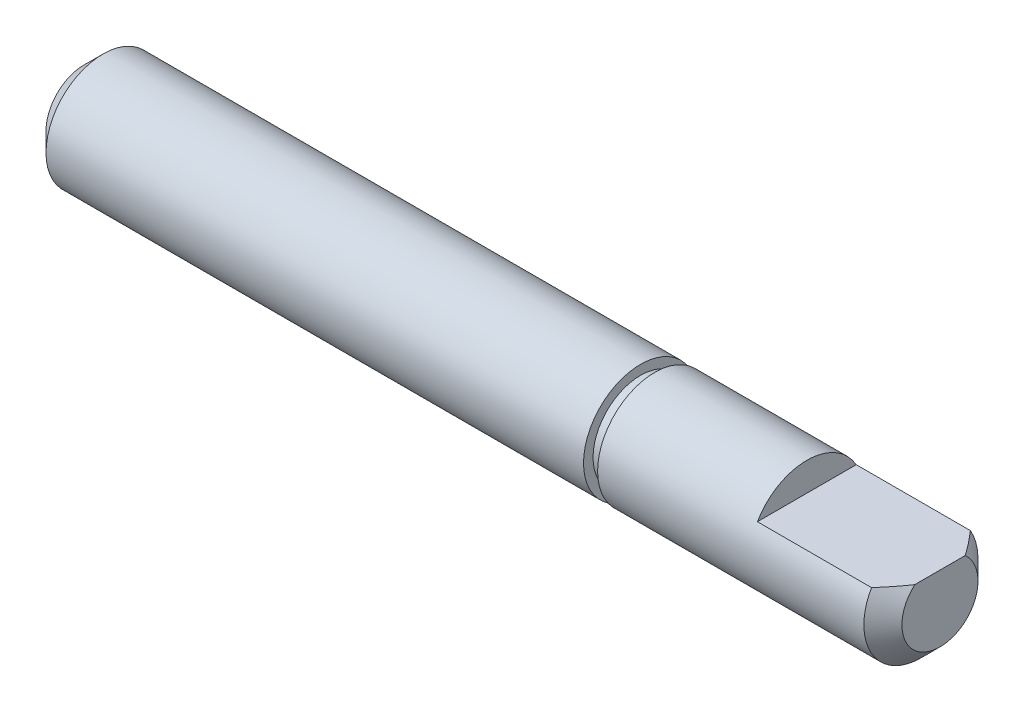
ISO-10303-21;
HEADER;
FILE_DESCRIPTION(('STEP AP214'),'2;1');
FILE_NAME('part.step','',(''),(''),'','','');
FILE_SCHEMA(('AUTOMOTIVE_DESIGN { 1 0 10303 214 1 1 1 1 }'));
ENDSEC;
DATA;
#1=APPLICATION_CONTEXT('core data for automotive mechanical design processes');
#2=APPLICATION_PROTOCOL_DEFINITION('international standard','automotive_design',2000,#1);
#3=PRODUCT_CONTEXT('',#1,'mechanical');
#4=PRODUCT('Part','Part','',(#3));
#5=PRODUCT_RELATED_PRODUCT_CATEGORY('part','',(#4));
#6=PRODUCT_DEFINITION_FORMATION('','',#4);
#7=PRODUCT_DEFINITION_CONTEXT('part definition',#1,'design');
#8=PRODUCT_DEFINITION('design','',#6,#7);
#9=PRODUCT_DEFINITION_SHAPE('','',#8);
#10=(LENGTH_UNIT() NAMED_UNIT(*) SI_UNIT(.MILLI.,.METRE.));
#11=(NAMED_UNIT(*) PLANE_ANGLE_UNIT() SI_UNIT($,.RADIAN.));
#12=(NAMED_UNIT(*) SI_UNIT($,.STERADIAN.) SOLID_ANGLE_UNIT());
#13=UNCERTAINTY_MEASURE_WITH_UNIT(LENGTH_MEASURE(1.E-05),#10,'distance_accuracy_value','');
#14=(GEOMETRIC_REPRESENTATION_CONTEXT(3) GLOBAL_UNCERTAINTY_ASSIGNED_CONTEXT((#13)) GLOBAL_UNIT_ASSIGNED_CONTEXT((#10,
#11,#12)) REPRESENTATION_CONTEXT('',''));
#15=CARTESIAN_POINT('',(0.,0.,0.));
#16=DIRECTION('',(0.,0.,1.));
#17=DIRECTION('',(1.,0.,0.));
#18=AXIS2_PLACEMENT_3D('',#15,#16,#17);
#19=CARTESIAN_POINT('',(0.,0.,0.));
#20=DIRECTION('',(1.,0.,0.));
#21=DIRECTION('',(0.,0.,-1.));
#22=AXIS2_PLACEMENT_3D('',#19,#20,#21);
#23=PLANE('',#22);
#24=CARTESIAN_POINT('',(0.,0.,0.));
#25=DIRECTION('',(-1.,0.,0.));
#26=DIRECTION('',(0.,0.,1.));
#27=AXIS2_PLACEMENT_3D('',#24,#25,#26);
#28=CIRCLE('',#27,2.);
#29=CARTESIAN_POINT('',(0.,0.,2.));
#30=VERTEX_POINT('',#29);
#31=EDGE_CURVE('E65',#30,#30,#28,.T.);
#32=ORIENTED_EDGE('',*,*,#31,.T.);
#33=EDGE_LOOP('',(#32));
#34=FACE_BOUND('',#33,.T.);
#35=ADVANCED_FACE('F31',(#34),#23,.F.);
#36=CARTESIAN_POINT('',(1.,0.,0.));
#37=DIRECTION('',(1.,0.,0.));
#38=DIRECTION('',(0.,0.,-1.));
#39=AXIS2_PLACEMENT_3D('',#36,#37,#38);
#40=CONICAL_SURFACE('',#39,3.,0.785398163397448);
#41=ORIENTED_EDGE('',*,*,#31,.F.);
#42=EDGE_LOOP('',(#41));
#43=FACE_BOUND('',#42,.T.);
#44=CARTESIAN_POINT('',(1.,0.,0.));
#45=DIRECTION('',(-1.,0.,0.));
#46=DIRECTION('',(0.,0.,1.));
#47=AXIS2_PLACEMENT_3D('',#44,#45,#46);
#48=CIRCLE('',#47,3.);
#49=CARTESIAN_POINT('',(1.,0.,3.));
#50=VERTEX_POINT('',#49);
#51=EDGE_CURVE('E93',#50,#50,#48,.T.);
#52=ORIENTED_EDGE('',*,*,#51,.T.);
#53=EDGE_LOOP('',(#52));
#54=FACE_BOUND('',#53,.T.);
#55=ADVANCED_FACE('F100',(#43,#54),#40,.T.);
#56=CARTESIAN_POINT('',(-55.9394280762565,0.,0.));
#57=DIRECTION('',(-1.,0.,0.));
#58=DIRECTION('',(0.,0.,1.));
#59=AXIS2_PLACEMENT_3D('',#56,#57,#58);
#60=CYLINDRICAL_SURFACE('',#59,3.);
#61=ORIENTED_EDGE('',*,*,#51,.F.);
#62=EDGE_LOOP('',(#61));
#63=FACE_BOUND('',#62,.T.);
#64=CARTESIAN_POINT('',(29.26,0.,0.));
#65=DIRECTION('',(-1.,0.,0.));
#66=DIRECTION('',(0.,0.,1.));
#67=AXIS2_PLACEMENT_3D('',#64,#65,#66);
#68=CIRCLE('',#67,3.);
#69=CARTESIAN_POINT('',(29.26,0.,3.));
#70=VERTEX_POINT('',#69);
#71=EDGE_CURVE('E90',#70,#70,#68,.T.);
#72=ORIENTED_EDGE('',*,*,#71,.T.);
#73=EDGE_LOOP('',(#72));
#74=FACE_BOUND('',#73,.T.);
#75=ADVANCED_FACE('F103',(#63,#74),#60,.T.);
#76=CARTESIAN_POINT('',(29.26,3.,0.));
#77=DIRECTION('',(-1.,0.,0.));
#78=DIRECTION('',(0.,0.,1.));
#79=AXIS2_PLACEMENT_3D('',#76,#77,#78);
#80=PLANE('',#79);
#81=ORIENTED_EDGE('',*,*,#71,.F.);
#82=EDGE_LOOP('',(#81));
#83=FACE_BOUND('',#82,.T.);
#84=CARTESIAN_POINT('',(29.26,0.,0.));
#85=DIRECTION('',(-1.,0.,0.));
#86=DIRECTION('',(0.,0.,1.));
#87=AXIS2_PLACEMENT_3D('',#84,#85,#86);
#88=CIRCLE('',#87,2.5);
#89=CARTESIAN_POINT('',(29.26,0.,2.5));
#90=VERTEX_POINT('',#89);
#91=EDGE_CURVE('E87',#90,#90,#88,.T.);
#92=ORIENTED_EDGE('',*,*,#91,.T.);
#93=EDGE_LOOP('',(#92));
#94=FACE_BOUND('',#93,.T.);
#95=ADVANCED_FACE('F108',(#83,#94),#80,.F.);
#96=CARTESIAN_POINT('',(-55.9394280762565,0.,0.));
#97=DIRECTION('',(-1.,0.,0.));
#98=DIRECTION('',(0.,0.,1.));
#99=AXIS2_PLACEMENT_3D('',#96,#97,#98);
#100=CYLINDRICAL_SURFACE('',#99,2.5);
#101=ORIENTED_EDGE('',*,*,#91,.F.);
#102=EDGE_LOOP('',(#101));
#103=FACE_BOUND('',#102,.T.);
#104=CARTESIAN_POINT('',(30.,0.,0.));
#105=DIRECTION('',(-1.,0.,0.));
#106=DIRECTION('',(0.,0.,1.));
#107=AXIS2_PLACEMENT_3D('',#104,#105,#106);
#108=CIRCLE('',#107,2.5);
#109=CARTESIAN_POINT('',(30.,0.,2.5));
#110=VERTEX_POINT('',#109);
#111=EDGE_CURVE('E84',#110,#110,#108,.T.);
#112=ORIENTED_EDGE('',*,*,#111,.T.);
#113=EDGE_LOOP('',(#112));
#114=FACE_BOUND('',#113,.T.);
#115=ADVANCED_FACE('F114',(#103,#114),#100,.T.);
#116=CARTESIAN_POINT('',(30.,2.5,0.));
#117=DIRECTION('',(1.,0.,0.));
#118=DIRECTION('',(0.,0.,-1.));
#119=AXIS2_PLACEMENT_3D('',#116,#117,#118);
#120=PLANE('',#119);
#121=ORIENTED_EDGE('',*,*,#111,.F.);
#122=EDGE_LOOP('',(#121));
#123=FACE_BOUND('',#122,.T.);
#124=CARTESIAN_POINT('',(30.,0.,0.));
#125=DIRECTION('',(-1.,0.,0.));
#126=DIRECTION('',(0.,0.,1.));
#127=AXIS2_PLACEMENT_3D('',#124,#125,#126);
#128=CIRCLE('',#127,3.);
#129=CARTESIAN_POINT('',(30.,0.,3.));
#130=VERTEX_POINT('',#129);
#131=EDGE_CURVE('E77',#130,#130,#128,.T.);
#132=ORIENTED_EDGE('',*,*,#131,.T.);
#133=EDGE_LOOP('',(#132));
#134=FACE_BOUND('',#133,.T.);
#135=ADVANCED_FACE('F120',(#123,#134),#120,.F.);
#136=CARTESIAN_POINT('',(-55.9394280762565,0.,0.));
#137=DIRECTION('',(-1.,0.,0.));
#138=DIRECTION('',(0.,0.,1.));
#139=AXIS2_PLACEMENT_3D('',#136,#137,#138);
#140=CYLINDRICAL_SURFACE('',#139,3.);
#141=CARTESIAN_POINT('',(44.,0.,0.));
#142=DIRECTION('',(-1.,0.,0.));
#143=DIRECTION('',(0.,0.,1.));
#144=AXIS2_PLACEMENT_3D('',#141,#142,#143);
#145=CIRCLE('',#144,3.);
#146=CARTESIAN_POINT('',(43.9999999999999,1.5,-2.59807621135347));
#147=VERTEX_POINT('',#146);
#148=CARTESIAN_POINT('',(44.,1.5,2.59807621135332));
#149=VERTEX_POINT('',#148);
#150=EDGE_CURVE('E71',#147,#149,#145,.T.);
#151=ORIENTED_EDGE('',*,*,#150,.T.);
#152=DIRECTION('',(-1.,0.,0.));
#153=VECTOR('',#152,1.);
#154=CARTESIAN_POINT('',(-55.9394280762565,1.5,2.59807621135332));
#155=LINE('',#154,#153);
#156=CARTESIAN_POINT('',(38.,1.5,2.59807621135332));
#157=VERTEX_POINT('',#156);
#158=EDGE_CURVE('E73',#149,#157,#155,.T.);
#159=ORIENTED_EDGE('',*,*,#158,.T.);
#160=CARTESIAN_POINT('',(38.,0.,0.));
#161=DIRECTION('',(1.,0.,0.));
#162=DIRECTION('',(0.,0.,-1.));
#163=AXIS2_PLACEMENT_3D('',#160,#161,#162);
#164=CIRCLE('',#163,3.);
#165=CARTESIAN_POINT('',(38.,1.5,-2.59807621135332));
#166=VERTEX_POINT('',#165);
#167=EDGE_CURVE('E11',#166,#157,#164,.T.);
#168=ORIENTED_EDGE('',*,*,#167,.F.);
#169=DIRECTION('',(-1.,0.,0.));
#170=VECTOR('',#169,1.);
#171=CARTESIAN_POINT('',(-55.9394280762565,1.5,-2.59807621135332));
#172=LINE('',#171,#170);
#173=EDGE_CURVE('E72',#166,#147,#172,.F.);
#174=ORIENTED_EDGE('',*,*,#173,.T.);
#175=EDGE_LOOP('',(#151,#159,#168,#174));
#176=FACE_BOUND('',#175,.T.);
#177=ORIENTED_EDGE('',*,*,#131,.F.);
#178=EDGE_LOOP('',(#177));
#179=FACE_BOUND('',#178,.T.);
#180=ADVANCED_FACE('F126',(#176,#179),#140,.T.);
#181=CARTESIAN_POINT('',(45.,0.,0.));
#182=DIRECTION('',(-1.,0.,0.));
#183=DIRECTION('',(0.,0.,1.));
#184=AXIS2_PLACEMENT_3D('',#181,#182,#183);
#185=CONICAL_SURFACE('',#184,2.,0.785398163397448);
#186=ORIENTED_EDGE('',*,*,#150,.F.);
#187=CARTESIAN_POINT('',(40.3501424818211,1.5,-6.47847242890489));
#188=CARTESIAN_POINT('',(40.5159520862638,1.5,-6.30826369867918));
#189=CARTESIAN_POINT('',(40.6816034889832,1.5,-6.13790027920319));
#190=CARTESIAN_POINT('',(41.0124752643252,1.5,-5.79674247770871));
#191=CARTESIAN_POINT('',(41.1776956197278,1.5,-5.62594807899323));
#192=CARTESIAN_POINT('',(41.5079039197653,1.5,-5.28348168449548));
#193=CARTESIAN_POINT('',(41.6728907579318,1.5,-5.11180862097958));
#194=CARTESIAN_POINT('',(42.0021080240068,1.5,-4.76774856310163));
#195=CARTESIAN_POINT('',(42.1663384752345,1.5,-4.59536159106456));
#196=CARTESIAN_POINT('',(42.5060291970537,1.5,-4.23666789611256));
#197=CARTESIAN_POINT('',(42.6814095921959,1.5,-4.05028536889546));
#198=CARTESIAN_POINT('',(43.0304382923766,1.5,-3.67586926913106));
#199=CARTESIAN_POINT('',(43.2040864240964,1.5,-3.48783553484467));
#200=CARTESIAN_POINT('',(43.5484901825543,1.5,-3.10952345364842));
#201=CARTESIAN_POINT('',(43.7192489709177,1.5,-2.9192480066554));
#202=CARTESIAN_POINT('',(43.9719348716298,1.5,-2.63083294510936));
#203=CARTESIAN_POINT('',(44.0555815757736,1.5,-2.53420212111611));
#204=CARTESIAN_POINT('',(44.2213059774712,1.5,-2.33960707469671));
#205=CARTESIAN_POINT('',(44.303383757418,1.5,-2.2416429227562));
#206=CARTESIAN_POINT('',(44.4286615843265,1.5,-2.0887167275369));
#207=CARTESIAN_POINT('',(44.472626577234,1.5,-2.034382455066));
#208=CARTESIAN_POINT('',(44.5597503909505,1.5,-1.92507187430936));
#209=CARTESIAN_POINT('',(44.6029091929524,1.5,-1.87009555109421));
#210=CARTESIAN_POINT('',(44.7310285419292,1.5,-1.70390033053899));
#211=CARTESIAN_POINT('',(44.8145333237071,1.5,-1.59153429165245));
#212=CARTESIAN_POINT('',(44.9347437158433,1.5,-1.42017484402163));
#213=CARTESIAN_POINT('',(44.9738136810241,1.5,-1.36284183018697));
#214=CARTESIAN_POINT('',(45.0499397182522,1.5,-1.24685873268904));
#215=CARTESIAN_POINT('',(45.0869961327253,1.5,-1.1882088753816));
#216=CARTESIAN_POINT('',(45.1584247767003,1.5,-1.06941468813148));
#217=CARTESIAN_POINT('',(45.1928012528157,1.5,-1.00927293018919));
#218=CARTESIAN_POINT('',(45.2580618954055,1.5,-0.887137466656313));
#219=CARTESIAN_POINT('',(45.2889478732852,1.5,-0.825144742944128));
#220=CARTESIAN_POINT('',(45.3408369374574,1.5,-0.710582429854385));
#221=CARTESIAN_POINT('',(45.3626140477314,1.5,-0.658366386773148));
#222=CARTESIAN_POINT('',(45.4022561910561,1.5,-0.552445148046175));
#223=CARTESIAN_POINT('',(45.4201210949502,1.5,-0.49873990330217));
#224=CARTESIAN_POINT('',(45.4509165366266,1.5,-0.390307719213205));
#225=CARTESIAN_POINT('',(45.4638801053694,1.5,-0.335590324263726));
#226=CARTESIAN_POINT('',(45.4841711048827,1.5,-0.225115857148013));
#227=CARTESIAN_POINT('',(45.491500866888,1.5,-0.169359224804944));
#228=CARTESIAN_POINT('',(45.4992353332767,1.5,-0.066765371328307));
#229=CARTESIAN_POINT('',(45.5005947179691,1.5,-0.0199992984182228));
#230=CARTESIAN_POINT('',(45.4989291350902,1.5,0.0734512260301734));
#231=CARTESIAN_POINT('',(45.4959045662133,1.5,0.120135684604249));
#232=CARTESIAN_POINT('',(45.4856365518579,1.5,0.213172057751733));
#233=CARTESIAN_POINT('',(45.4783805027367,1.5,0.259522558289055));
#234=CARTESIAN_POINT('',(45.4600360089314,1.5,0.351454902221314));
#235=CARTESIAN_POINT('',(45.4489467272758,1.5,0.397036575464271));
#236=CARTESIAN_POINT('',(45.4167253416798,1.5,0.511000182067713));
#237=CARTESIAN_POINT('',(45.3933794032478,1.5,0.578755158886489));
#238=CARTESIAN_POINT('',(45.3407625233567,1.5,0.711914813448711));
#239=CARTESIAN_POINT('',(45.3114869225675,1.5,0.777317595029564));
#240=CARTESIAN_POINT('',(45.2483913129755,1.5,0.906261279512893));
#241=CARTESIAN_POINT('',(45.2145499418189,1.5,0.969791607649594));
#242=CARTESIAN_POINT('',(45.161331570924,1.5,1.06365520434653));
#243=CARTESIAN_POINT('',(45.1431858486537,1.5,1.0946995356493));
#244=CARTESIAN_POINT('',(45.1061795312812,1.5,1.1563580055258));
#245=CARTESIAN_POINT('',(45.0873189663109,1.5,1.18697216215777));
#246=CARTESIAN_POINT('',(45.0238230157926,1.5,1.28773744283668));
#247=CARTESIAN_POINT('',(44.9778475010245,1.5,1.35704479787385));
#248=CARTESIAN_POINT('',(44.8834919997799,1.5,1.49400952052217));
#249=CARTESIAN_POINT('',(44.8351114381409,1.5,1.56166648762318));
#250=CARTESIAN_POINT('',(44.7365173937338,1.5,1.69570533702856));
#251=CARTESIAN_POINT('',(44.6863025598621,1.5,1.76208622212586));
#252=CARTESIAN_POINT('',(44.5844923935942,1.5,1.89378308239195));
#253=CARTESIAN_POINT('',(44.5328969722718,1.5,1.95909898852527));
#254=CARTESIAN_POINT('',(44.3762464539777,1.5,2.15409596435317));
#255=CARTESIAN_POINT('',(44.2695840034847,1.5,2.28248406252184));
#256=CARTESIAN_POINT('',(44.0535958624045,1.5,2.53688175416029));
#257=CARTESIAN_POINT('',(43.9442713612835,1.5,2.66289236684322));
#258=CARTESIAN_POINT('',(43.7234378411627,1.5,2.91365735294262));
#259=CARTESIAN_POINT('',(43.611923225966,1.5,3.0384067884938));
#260=CARTESIAN_POINT('',(43.3875598379099,1.5,3.28672067024059));
#261=CARTESIAN_POINT('',(43.274710924725,1.5,3.41028498927986));
#262=CARTESIAN_POINT('',(42.9350680196975,1.5,3.77928724377803));
#263=CARTESIAN_POINT('',(42.7068445156959,1.5,4.02340812529839));
#264=CARTESIAN_POINT('',(42.3013857777959,1.5,4.4531675363293));
#265=CARTESIAN_POINT('',(42.1246036403031,1.5,4.63923593270348));
#266=CARTESIAN_POINT('',(41.7700254392821,1.5,5.01055792393738));
#267=CARTESIAN_POINT('',(41.5922289714406,1.5,5.19581113288312));
#268=CARTESIAN_POINT('',(41.2372935476066,1.5,5.56428028345273));
#269=CARTESIAN_POINT('',(41.0601596378416,1.5,5.74750109273868));
#270=CARTESIAN_POINT('',(40.7054577645236,1.5,6.11336386796404));
#271=CARTESIAN_POINT('',(40.5278900295594,1.5,6.29600605545783));
#272=CARTESIAN_POINT('',(40.3501424818211,1.5,6.47847242890489));
#273=B_SPLINE_CURVE_WITH_KNOTS('',3,(#187,#188,#189,#190,#191,#192,#193,#194,#195,#196,#197,
#198,#199,#200,#201,#202,#203,#204,#205,#206,#207,#208,#209,#210,#211,#212,#213,#214,#215,#216,
#217,#218,#219,#220,#221,#222,#223,#224,#225,#226,#227,#228,#229,#230,#231,#232,#233,#234,#235,
#236,#237,#238,#239,#240,#241,#242,#243,#244,#245,#246,#247,#248,#249,#250,#251,#252,#253,#254,
#255,#256,#257,#258,#259,#260,#261,#262,#263,#264,#265,#266,#267,#268,#269,#270,#271,#272),
.UNSPECIFIED.,.F.,.F.,(4,2,2,2,2,2,2,2,2,2,2,2,2,2,2,2,2,2,2,2,2,2,2,2,2,2,2,2,2,2,2,2,2,2,2,2,
2,2,2,2,2,2,4),(0.,0.712864120230382,1.42575629575465,2.14005884380526,2.85433922071848,
3.62210073371865,4.38993830854784,5.15687284745173,5.54027881960332,5.92366460133491,
6.13333808388303,6.34301645165394,6.76283712666391,6.97094607959557,7.17901952990474,
7.38675626761149,7.59438469975129,7.76398732508715,7.93359554880473,8.1020394671045,
8.27041364675703,8.41057087981281,8.55071536720815,8.69127942846509,8.83187420074536,
9.0464695222025,9.26123412423648,9.47704086944861,9.584909499241,9.69277358722368,
9.94220498520977,10.1916963239428,10.4413752952075,10.6910703876612,11.1917436053099,
11.6921970732297,12.1941606093828,12.6961774140759,13.6987090221947,14.4686811778264,
15.2389853258994,16.0035212050234,16.7677164032783),.UNSPECIFIED.);
#274=CARTESIAN_POINT('',(45.,1.5,-1.32287565553229));
#275=VERTEX_POINT('',#274);
#276=EDGE_CURVE('E51',#147,#275,#273,.T.);
#277=ORIENTED_EDGE('',*,*,#276,.T.);
#278=CARTESIAN_POINT('',(45.,0.,0.));
#279=DIRECTION('',(-1.,0.,0.));
#280=DIRECTION('',(0.,0.,1.));
#281=AXIS2_PLACEMENT_3D('',#278,#279,#280);
#282=CIRCLE('',#281,2.);
#283=CARTESIAN_POINT('',(45.,1.5,1.3228756555323));
#284=VERTEX_POINT('',#283);
#285=EDGE_CURVE('E69',#275,#284,#282,.T.);
#286=ORIENTED_EDGE('',*,*,#285,.T.);
#287=EDGE_CURVE('E45',#284,#149,#273,.T.);
#288=ORIENTED_EDGE('',*,*,#287,.T.);
#289=EDGE_LOOP('',(#186,#277,#286,#288));
#290=FACE_BOUND('',#289,.T.);
#291=ADVANCED_FACE('F68',(#290),#185,.T.);
#292=CARTESIAN_POINT('',(45.,2.,0.));
#293=DIRECTION('',(-1.,0.,0.));
#294=DIRECTION('',(0.,0.,1.));
#295=AXIS2_PLACEMENT_3D('',#292,#293,#294);
#296=PLANE('',#295);
#297=ORIENTED_EDGE('',*,*,#285,.F.);
#298=DIRECTION('',(0.,0.,1.));
#299=VECTOR('',#298,1.);
#300=CARTESIAN_POINT('',(45.,1.5,0.));
#301=LINE('',#300,#299);
#302=EDGE_CURVE('E38',#275,#284,#301,.T.);
#303=ORIENTED_EDGE('',*,*,#302,.T.);
#304=EDGE_LOOP('',(#297,#303));
#305=FACE_BOUND('',#304,.T.);
#306=ADVANCED_FACE('F75',(#305),#296,.F.);
#307=CARTESIAN_POINT('',(38.,1.5,3.87637203928377));
#308=DIRECTION('',(1.,0.,0.));
#309=DIRECTION('',(0.,0.,-1.));
#310=AXIS2_PLACEMENT_3D('',#307,#308,#309);
#311=PLANE('',#310);
#312=ORIENTED_EDGE('',*,*,#167,.T.);
#313=DIRECTION('',(0.,0.,-1.));
#314=VECTOR('',#313,1.);
#315=CARTESIAN_POINT('',(38.,1.5,3.87637203928377));
#316=LINE('',#315,#314);
#317=EDGE_CURVE('E205',#157,#166,#316,.T.);
#318=ORIENTED_EDGE('',*,*,#317,.T.);
#319=EDGE_LOOP('',(#312,#318));
#320=FACE_BOUND('',#319,.T.);
#321=ADVANCED_FACE('F179',(#320),#311,.T.);
#322=CARTESIAN_POINT('',(38.,1.5,3.87637203928377));
#323=DIRECTION('',(0.,-1.,0.));
#324=DIRECTION('',(0.,0.,-1.));
#325=AXIS2_PLACEMENT_3D('',#322,#323,#324);
#326=PLANE('',#325);
#327=ORIENTED_EDGE('',*,*,#317,.F.);
#328=ORIENTED_EDGE('',*,*,#158,.F.);
#329=ORIENTED_EDGE('',*,*,#287,.F.);
#330=ORIENTED_EDGE('',*,*,#302,.F.);
#331=ORIENTED_EDGE('',*,*,#276,.F.);
#332=ORIENTED_EDGE('',*,*,#173,.F.);
#333=EDGE_LOOP('',(#327,#328,#329,#330,#331,#332));
#334=FACE_BOUND('',#333,.T.);
#335=ADVANCED_FACE('F61',(#334),#326,.F.);
#336=CLOSED_SHELL('',(#35,#55,#75,#95,#115,#135,#180,#291,#306,#321,#335));
#337=MANIFOLD_SOLID_BREP('B2',#336);
#338=ADVANCED_BREP_SHAPE_REPRESENTATION('',(#18,#337),#14);
#339=SHAPE_DEFINITION_REPRESENTATION(#9,#338);
ENDSEC;
END-ISO-10303-21;
